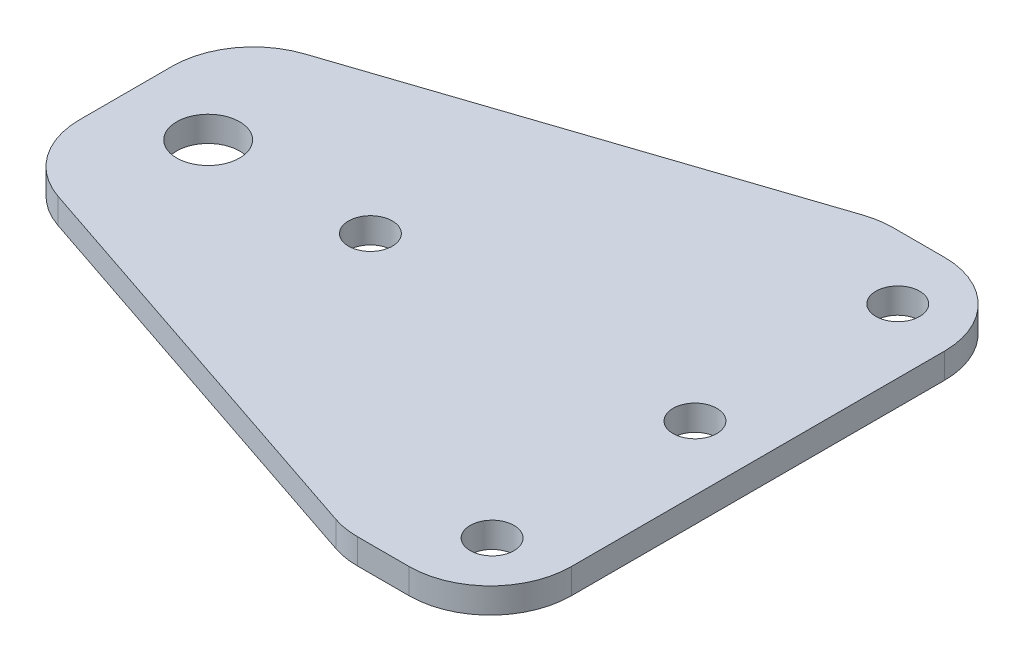
ISO-10303-21;
HEADER;
FILE_DESCRIPTION(('STEP AP214'),'2;1');
FILE_NAME('part.step','',(''),(''),'','','');
FILE_SCHEMA(('AUTOMOTIVE_DESIGN { 1 0 10303 214 1 1 1 1 }'));
ENDSEC;
DATA;
#1=APPLICATION_CONTEXT('core data for automotive mechanical design processes');
#2=APPLICATION_PROTOCOL_DEFINITION('international standard','automotive_design',2000,#1);
#3=PRODUCT_CONTEXT('',#1,'mechanical');
#4=PRODUCT('Part','Part','',(#3));
#5=PRODUCT_RELATED_PRODUCT_CATEGORY('part','',(#4));
#6=PRODUCT_DEFINITION_FORMATION('','',#4);
#7=PRODUCT_DEFINITION_CONTEXT('part definition',#1,'design');
#8=PRODUCT_DEFINITION('design','',#6,#7);
#9=PRODUCT_DEFINITION_SHAPE('','',#8);
#10=(LENGTH_UNIT() NAMED_UNIT(*) SI_UNIT(.MILLI.,.METRE.));
#11=(NAMED_UNIT(*) PLANE_ANGLE_UNIT() SI_UNIT($,.RADIAN.));
#12=(NAMED_UNIT(*) SI_UNIT($,.STERADIAN.) SOLID_ANGLE_UNIT());
#13=UNCERTAINTY_MEASURE_WITH_UNIT(LENGTH_MEASURE(1.E-05),#10,'distance_accuracy_value','');
#14=(GEOMETRIC_REPRESENTATION_CONTEXT(3) GLOBAL_UNCERTAINTY_ASSIGNED_CONTEXT((#13)) GLOBAL_UNIT_ASSIGNED_CONTEXT((#10,
#11,#12)) REPRESENTATION_CONTEXT('',''));
#15=CARTESIAN_POINT('',(0.,0.,0.));
#16=DIRECTION('',(0.,0.,1.));
#17=DIRECTION('',(1.,0.,0.));
#18=AXIS2_PLACEMENT_3D('',#15,#16,#17);
#19=CARTESIAN_POINT('',(0.,3.125,0.));
#20=DIRECTION('',(0.,-1.,0.));
#21=DIRECTION('',(0.,0.,-1.));
#22=AXIS2_PLACEMENT_3D('',#19,#20,#21);
#23=PLANE('',#22);
#24=CARTESIAN_POINT('',(70.0740556078438,3.125,-12.9660845153906));
#25=DIRECTION('',(0.,1.,0.));
#26=DIRECTION('',(0.,0.,1.));
#27=AXIS2_PLACEMENT_3D('',#24,#25,#26);
#28=CIRCLE('',#27,2.7);
#29=CARTESIAN_POINT('',(70.0740556078438,3.125,-10.2660845153906));
#30=VERTEX_POINT('',#29);
#31=EDGE_CURVE('E249',#30,#30,#28,.T.);
#32=ORIENTED_EDGE('',*,*,#31,.F.);
#33=EDGE_LOOP('',(#32));
#34=FACE_BOUND('',#33,.T.);
#35=CARTESIAN_POINT('',(10.0740556078438,3.125,-12.9660845153906));
#36=DIRECTION('',(0.,1.,0.));
#37=DIRECTION('',(0.,0.,1.));
#38=AXIS2_PLACEMENT_3D('',#35,#36,#37);
#39=CIRCLE('',#38,3.87500000000001);
#40=CARTESIAN_POINT('',(10.0740556078438,3.125,-9.09108451539061));
#41=VERTEX_POINT('',#40);
#42=EDGE_CURVE('E237',#41,#41,#39,.T.);
#43=ORIENTED_EDGE('',*,*,#42,.F.);
#44=EDGE_LOOP('',(#43));
#45=FACE_BOUND('',#44,.T.);
#46=DIRECTION('',(0.,0.,-1.));
#47=VECTOR('',#46,1.);
#48=CARTESIAN_POINT('',(77.9999999999998,3.125,-45.8102249731023));
#49=LINE('',#48,#47);
#50=CARTESIAN_POINT('',(77.9999999999998,3.125,10.1897750268977));
#51=VERTEX_POINT('',#50);
#52=CARTESIAN_POINT('',(77.9999999999998,3.125,-35.8102249731023));
#53=VERTEX_POINT('',#52);
#54=EDGE_CURVE('E229',#51,#53,#49,.T.);
#55=ORIENTED_EDGE('',*,*,#54,.T.);
#56=CARTESIAN_POINT('',(67.9999999999998,3.125,-35.8102249731023));
#57=DIRECTION('',(0.,-1.,0.));
#58=DIRECTION('',(0.,0.,-1.));
#59=AXIS2_PLACEMENT_3D('',#56,#57,#58);
#60=CIRCLE('',#59,10.);
#61=CARTESIAN_POINT('',(67.9999999999998,3.125,-45.8102249731023));
#62=VERTEX_POINT('',#61);
#63=EDGE_CURVE('E181',#53,#62,#60,.F.);
#64=ORIENTED_EDGE('',*,*,#63,.T.);
#65=DIRECTION('',(-1.,0.,0.));
#66=VECTOR('',#65,1.);
#67=CARTESIAN_POINT('',(60.,3.125,-45.8102249731023));
#68=LINE('',#67,#66);
#69=CARTESIAN_POINT('',(61.6227766016838,3.125,-45.8102249731023));
#70=VERTEX_POINT('',#69);
#71=EDGE_CURVE('E143',#62,#70,#68,.T.);
#72=ORIENTED_EDGE('',*,*,#71,.T.);
#73=CARTESIAN_POINT('',(61.6227766016838,3.125,-35.8102249731023));
#74=DIRECTION('',(0.,-1.,0.));
#75=DIRECTION('',(0.,0.,-1.));
#76=AXIS2_PLACEMENT_3D('',#73,#74,#75);
#77=CIRCLE('',#76,10.);
#78=CARTESIAN_POINT('',(58.4604989415154,3.125,-45.2970579536074));
#79=VERTEX_POINT('',#78);
#80=EDGE_CURVE('E176',#70,#79,#77,.F.);
#81=ORIENTED_EDGE('',*,*,#80,.T.);
#82=DIRECTION('',(-0.948683298050514,0.,0.316227766016838));
#83=VECTOR('',#82,1.);
#84=CARTESIAN_POINT('',(0.,3.125,-25.8102249731023));
#85=LINE('',#84,#83);
#86=CARTESIAN_POINT('',(6.83772233983162,3.125,-28.0894657530462));
#87=VERTEX_POINT('',#86);
#88=EDGE_CURVE('E151',#79,#87,#85,.T.);
#89=ORIENTED_EDGE('',*,*,#88,.T.);
#90=CARTESIAN_POINT('',(10.,3.125,-18.6026327725411));
#91=DIRECTION('',(0.,-1.,0.));
#92=DIRECTION('',(0.,0.,-1.));
#93=AXIS2_PLACEMENT_3D('',#90,#91,#92);
#94=CIRCLE('',#93,10.);
#95=CARTESIAN_POINT('',(0.,3.125,-18.6026327725411));
#96=VERTEX_POINT('',#95);
#97=EDGE_CURVE('E174',#87,#96,#94,.F.);
#98=ORIENTED_EDGE('',*,*,#97,.T.);
#99=DIRECTION('',(0.,0.,1.));
#100=VECTOR('',#99,1.);
#101=CARTESIAN_POINT('',(0.,3.125,-25.8102249731023));
#102=LINE('',#101,#100);
#103=CARTESIAN_POINT('',(0.,3.125,-7.18600771898826));
#104=VERTEX_POINT('',#103);
#105=EDGE_CURVE('E155',#96,#104,#102,.T.);
#106=ORIENTED_EDGE('',*,*,#105,.T.);
#107=CARTESIAN_POINT('',(10.,3.125,-7.18600771898826));
#108=DIRECTION('',(0.,-1.,0.));
#109=DIRECTION('',(0.,0.,-1.));
#110=AXIS2_PLACEMENT_3D('',#107,#108,#109);
#111=CIRCLE('',#110,10.);
#112=CARTESIAN_POINT('',(6.81075537774013,3.125,2.29179364733012));
#113=VERTEX_POINT('',#112);
#114=EDGE_CURVE('E172',#104,#113,#111,.F.);
#115=ORIENTED_EDGE('',*,*,#114,.T.);
#116=DIRECTION('',(0.947780136631838,0.,0.318924462225987));
#117=VECTOR('',#116,1.);
#118=CARTESIAN_POINT('',(0.,3.125,0.));
#119=LINE('',#118,#117);
#120=CARTESIAN_POINT('',(58.4481294130737,3.125,19.6675763932161));
#121=VERTEX_POINT('',#120);
#122=EDGE_CURVE('E211',#113,#121,#119,.T.);
#123=ORIENTED_EDGE('',*,*,#122,.T.);
#124=CARTESIAN_POINT('',(61.6373740353336,3.125,10.1897750268977));
#125=DIRECTION('',(0.,-1.,0.));
#126=DIRECTION('',(0.,0.,-1.));
#127=AXIS2_PLACEMENT_3D('',#124,#125,#126);
#128=CIRCLE('',#127,10.);
#129=CARTESIAN_POINT('',(61.6373740353336,3.125,20.1897750268977));
#130=VERTEX_POINT('',#129);
#131=EDGE_CURVE('E54',#121,#130,#128,.F.);
#132=ORIENTED_EDGE('',*,*,#131,.T.);
#133=DIRECTION('',(1.,0.,0.));
#134=VECTOR('',#133,1.);
#135=CARTESIAN_POINT('',(77.9999999999998,3.125,20.1897750268977));
#136=LINE('',#135,#134);
#137=CARTESIAN_POINT('',(67.9999999999998,3.125,20.1897750268977));
#138=VERTEX_POINT('',#137);
#139=EDGE_CURVE('E231',#130,#138,#136,.T.);
#140=ORIENTED_EDGE('',*,*,#139,.T.);
#141=CARTESIAN_POINT('',(67.9999999999998,3.125,10.1897750268977));
#142=DIRECTION('',(0.,-1.,0.));
#143=DIRECTION('',(0.,0.,-1.));
#144=AXIS2_PLACEMENT_3D('',#141,#142,#143);
#145=CIRCLE('',#144,10.);
#146=EDGE_CURVE('E179',#138,#51,#145,.F.);
#147=ORIENTED_EDGE('',*,*,#146,.T.);
#148=EDGE_LOOP('',(#55,#64,#72,#81,#89,#98,#106,#115,#123,#132,#140,#147));
#149=FACE_BOUND('',#148,.T.);
#150=CARTESIAN_POINT('',(70.0740556078438,3.125,12.0339154846094));
#151=DIRECTION('',(0.,1.,0.));
#152=DIRECTION('',(0.,0.,1.));
#153=AXIS2_PLACEMENT_3D('',#150,#151,#152);
#154=CIRCLE('',#153,2.7);
#155=CARTESIAN_POINT('',(70.0740556078438,3.125,14.7339154846094));
#156=VERTEX_POINT('',#155);
#157=EDGE_CURVE('E227',#156,#156,#154,.T.);
#158=ORIENTED_EDGE('',*,*,#157,.F.);
#159=EDGE_LOOP('',(#158));
#160=FACE_BOUND('',#159,.T.);
#161=CARTESIAN_POINT('',(70.0740556078438,3.125,-37.9660845153906));
#162=DIRECTION('',(0.,1.,0.));
#163=DIRECTION('',(0.,0.,1.));
#164=AXIS2_PLACEMENT_3D('',#161,#162,#163);
#165=CIRCLE('',#164,2.7);
#166=CARTESIAN_POINT('',(70.0740556078438,3.125,-35.2660845153906));
#167=VERTEX_POINT('',#166);
#168=EDGE_CURVE('E243',#167,#167,#165,.T.);
#169=ORIENTED_EDGE('',*,*,#168,.F.);
#170=EDGE_LOOP('',(#169));
#171=FACE_BOUND('',#170,.T.);
#172=CARTESIAN_POINT('',(30.0740556078438,3.125,-12.9660845153907));
#173=DIRECTION('',(0.,1.,0.));
#174=DIRECTION('',(0.,0.,1.));
#175=AXIS2_PLACEMENT_3D('',#172,#173,#174);
#176=CIRCLE('',#175,2.7);
#177=CARTESIAN_POINT('',(30.0740556078438,3.125,-10.2660845153907));
#178=VERTEX_POINT('',#177);
#179=EDGE_CURVE('E255',#178,#178,#176,.T.);
#180=ORIENTED_EDGE('',*,*,#179,.F.);
#181=EDGE_LOOP('',(#180));
#182=FACE_BOUND('',#181,.T.);
#183=ADVANCED_FACE('F32',(#34,#45,#149,#160,#171,#182),#23,.F.);
#184=CARTESIAN_POINT('',(0.,0.,0.));
#185=DIRECTION('',(0.,-1.,0.));
#186=DIRECTION('',(0.,0.,-1.));
#187=AXIS2_PLACEMENT_3D('',#184,#185,#186);
#188=PLANE('',#187);
#189=CARTESIAN_POINT('',(70.0740556078438,0.,-12.9660845153906));
#190=DIRECTION('',(0.,1.,0.));
#191=DIRECTION('',(0.,0.,1.));
#192=AXIS2_PLACEMENT_3D('',#189,#190,#191);
#193=CIRCLE('',#192,2.7);
#194=CARTESIAN_POINT('',(70.0740556078438,0.,-10.2660845153906));
#195=VERTEX_POINT('',#194);
#196=EDGE_CURVE('E252',#195,#195,#193,.T.);
#197=ORIENTED_EDGE('',*,*,#196,.T.);
#198=EDGE_LOOP('',(#197));
#199=FACE_BOUND('',#198,.T.);
#200=CARTESIAN_POINT('',(10.0740556078438,0.,-12.9660845153906));
#201=DIRECTION('',(0.,1.,0.));
#202=DIRECTION('',(0.,0.,1.));
#203=AXIS2_PLACEMENT_3D('',#200,#201,#202);
#204=CIRCLE('',#203,3.87500000000001);
#205=CARTESIAN_POINT('',(10.0740556078438,0.,-9.09108451539061));
#206=VERTEX_POINT('',#205);
#207=EDGE_CURVE('E240',#206,#206,#204,.T.);
#208=ORIENTED_EDGE('',*,*,#207,.T.);
#209=EDGE_LOOP('',(#208));
#210=FACE_BOUND('',#209,.T.);
#211=DIRECTION('',(-1.,0.,0.));
#212=VECTOR('',#211,1.);
#213=CARTESIAN_POINT('',(60.,0.,-45.8102249731023));
#214=LINE('',#213,#212);
#215=CARTESIAN_POINT('',(67.9999999999998,0.,-45.8102249731023));
#216=VERTEX_POINT('',#215);
#217=CARTESIAN_POINT('',(61.6227766016838,0.,-45.8102249731023));
#218=VERTEX_POINT('',#217);
#219=EDGE_CURVE('E140',#216,#218,#214,.T.);
#220=ORIENTED_EDGE('',*,*,#219,.F.);
#221=CARTESIAN_POINT('',(67.9999999999998,0.,-35.8102249731023));
#222=DIRECTION('',(0.,-1.,0.));
#223=DIRECTION('',(0.,0.,-1.));
#224=AXIS2_PLACEMENT_3D('',#221,#222,#223);
#225=CIRCLE('',#224,10.);
#226=CARTESIAN_POINT('',(77.9999999999998,0.,-35.8102249731023));
#227=VERTEX_POINT('',#226);
#228=EDGE_CURVE('E123',#216,#227,#225,.T.);
#229=ORIENTED_EDGE('',*,*,#228,.T.);
#230=DIRECTION('',(0.,0.,-1.));
#231=VECTOR('',#230,1.);
#232=CARTESIAN_POINT('',(77.9999999999998,0.,-45.8102249731023));
#233=LINE('',#232,#231);
#234=CARTESIAN_POINT('',(77.9999999999998,0.,10.1897750268977));
#235=VERTEX_POINT('',#234);
#236=EDGE_CURVE('E152',#235,#227,#233,.T.);
#237=ORIENTED_EDGE('',*,*,#236,.F.);
#238=CARTESIAN_POINT('',(67.9999999999998,0.,10.1897750268977));
#239=DIRECTION('',(0.,-1.,0.));
#240=DIRECTION('',(0.,0.,-1.));
#241=AXIS2_PLACEMENT_3D('',#238,#239,#240);
#242=CIRCLE('',#241,10.);
#243=CARTESIAN_POINT('',(67.9999999999998,0.,20.1897750268977));
#244=VERTEX_POINT('',#243);
#245=EDGE_CURVE('E134',#235,#244,#242,.T.);
#246=ORIENTED_EDGE('',*,*,#245,.T.);
#247=DIRECTION('',(1.,0.,0.));
#248=VECTOR('',#247,1.);
#249=CARTESIAN_POINT('',(77.9999999999998,0.,20.1897750268977));
#250=LINE('',#249,#248);
#251=CARTESIAN_POINT('',(61.6373740353336,0.,20.1897750268977));
#252=VERTEX_POINT('',#251);
#253=EDGE_CURVE('E157',#252,#244,#250,.T.);
#254=ORIENTED_EDGE('',*,*,#253,.F.);
#255=CARTESIAN_POINT('',(61.6373740353336,0.,10.1897750268977));
#256=DIRECTION('',(0.,-1.,0.));
#257=DIRECTION('',(0.,0.,-1.));
#258=AXIS2_PLACEMENT_3D('',#255,#256,#257);
#259=CIRCLE('',#258,10.);
#260=CARTESIAN_POINT('',(58.4481294130737,0.,19.6675763932161));
#261=VERTEX_POINT('',#260);
#262=EDGE_CURVE('E166',#252,#261,#259,.T.);
#263=ORIENTED_EDGE('',*,*,#262,.T.);
#264=DIRECTION('',(0.947780136631838,0.,0.318924462225987));
#265=VECTOR('',#264,1.);
#266=CARTESIAN_POINT('',(0.,0.,0.));
#267=LINE('',#266,#265);
#268=CARTESIAN_POINT('',(6.81075537774013,0.,2.29179364733012));
#269=VERTEX_POINT('',#268);
#270=EDGE_CURVE('E218',#269,#261,#267,.T.);
#271=ORIENTED_EDGE('',*,*,#270,.F.);
#272=CARTESIAN_POINT('',(10.,0.,-7.18600771898826));
#273=DIRECTION('',(0.,-1.,0.));
#274=DIRECTION('',(0.,0.,-1.));
#275=AXIS2_PLACEMENT_3D('',#272,#273,#274);
#276=CIRCLE('',#275,10.);
#277=CARTESIAN_POINT('',(0.,0.,-7.18600771898826));
#278=VERTEX_POINT('',#277);
#279=EDGE_CURVE('E144',#269,#278,#276,.T.);
#280=ORIENTED_EDGE('',*,*,#279,.T.);
#281=DIRECTION('',(0.,0.,1.));
#282=VECTOR('',#281,1.);
#283=CARTESIAN_POINT('',(0.,0.,-25.8102249731023));
#284=LINE('',#283,#282);
#285=CARTESIAN_POINT('',(0.,0.,-18.6026327725411));
#286=VERTEX_POINT('',#285);
#287=EDGE_CURVE('E204',#286,#278,#284,.T.);
#288=ORIENTED_EDGE('',*,*,#287,.F.);
#289=CARTESIAN_POINT('',(10.,0.,-18.6026327725411));
#290=DIRECTION('',(0.,-1.,0.));
#291=DIRECTION('',(0.,0.,-1.));
#292=AXIS2_PLACEMENT_3D('',#289,#290,#291);
#293=CIRCLE('',#292,10.);
#294=CARTESIAN_POINT('',(6.83772233983162,0.,-28.0894657530462));
#295=VERTEX_POINT('',#294);
#296=EDGE_CURVE('E163',#286,#295,#293,.T.);
#297=ORIENTED_EDGE('',*,*,#296,.T.);
#298=DIRECTION('',(-0.948683298050514,0.,0.316227766016838));
#299=VECTOR('',#298,1.);
#300=CARTESIAN_POINT('',(0.,0.,-25.8102249731023));
#301=LINE('',#300,#299);
#302=CARTESIAN_POINT('',(58.4604989415154,0.,-45.2970579536074));
#303=VERTEX_POINT('',#302);
#304=EDGE_CURVE('E222',#303,#295,#301,.T.);
#305=ORIENTED_EDGE('',*,*,#304,.F.);
#306=CARTESIAN_POINT('',(61.6227766016838,0.,-35.8102249731023));
#307=DIRECTION('',(0.,-1.,0.));
#308=DIRECTION('',(0.,0.,-1.));
#309=AXIS2_PLACEMENT_3D('',#306,#307,#308);
#310=CIRCLE('',#309,10.);
#311=EDGE_CURVE('E150',#303,#218,#310,.T.);
#312=ORIENTED_EDGE('',*,*,#311,.T.);
#313=EDGE_LOOP('',(#220,#229,#237,#246,#254,#263,#271,#280,#288,#297,#305,#312));
#314=FACE_BOUND('',#313,.T.);
#315=CARTESIAN_POINT('',(70.0740556078438,0.,12.0339154846094));
#316=DIRECTION('',(0.,1.,0.));
#317=DIRECTION('',(0.,0.,1.));
#318=AXIS2_PLACEMENT_3D('',#315,#316,#317);
#319=CIRCLE('',#318,2.7);
#320=CARTESIAN_POINT('',(70.0740556078438,0.,14.7339154846094));
#321=VERTEX_POINT('',#320);
#322=EDGE_CURVE('E234',#321,#321,#319,.T.);
#323=ORIENTED_EDGE('',*,*,#322,.T.);
#324=EDGE_LOOP('',(#323));
#325=FACE_BOUND('',#324,.T.);
#326=CARTESIAN_POINT('',(70.0740556078438,0.,-37.9660845153906));
#327=DIRECTION('',(0.,1.,0.));
#328=DIRECTION('',(0.,0.,1.));
#329=AXIS2_PLACEMENT_3D('',#326,#327,#328);
#330=CIRCLE('',#329,2.7);
#331=CARTESIAN_POINT('',(70.0740556078438,0.,-35.2660845153906));
#332=VERTEX_POINT('',#331);
#333=EDGE_CURVE('E246',#332,#332,#330,.T.);
#334=ORIENTED_EDGE('',*,*,#333,.T.);
#335=EDGE_LOOP('',(#334));
#336=FACE_BOUND('',#335,.T.);
#337=CARTESIAN_POINT('',(30.0740556078438,0.,-12.9660845153907));
#338=DIRECTION('',(0.,1.,0.));
#339=DIRECTION('',(0.,0.,1.));
#340=AXIS2_PLACEMENT_3D('',#337,#338,#339);
#341=CIRCLE('',#340,2.7);
#342=CARTESIAN_POINT('',(30.0740556078438,0.,-10.2660845153907));
#343=VERTEX_POINT('',#342);
#344=EDGE_CURVE('E258',#343,#343,#341,.T.);
#345=ORIENTED_EDGE('',*,*,#344,.T.);
#346=EDGE_LOOP('',(#345));
#347=FACE_BOUND('',#346,.T.);
#348=ADVANCED_FACE('F147',(#199,#210,#314,#325,#336,#347),#188,.T.);
#349=CARTESIAN_POINT('',(0.,3.125,-25.8102249731023));
#350=DIRECTION('',(0.316227766016838,0.,0.948683298050514));
#351=DIRECTION('',(0.948683298050514,0.,-0.316227766016838));
#352=AXIS2_PLACEMENT_3D('',#349,#350,#351);
#353=PLANE('',#352);
#354=ORIENTED_EDGE('',*,*,#88,.F.);
#355=DIRECTION('',(0.,-1.,0.));
#356=VECTOR('',#355,1.);
#357=CARTESIAN_POINT('',(58.4604989415154,3.125,-45.2970579536074));
#358=LINE('',#357,#356);
#359=EDGE_CURVE('E194',#79,#303,#358,.T.);
#360=ORIENTED_EDGE('',*,*,#359,.T.);
#361=ORIENTED_EDGE('',*,*,#304,.T.);
#362=DIRECTION('',(0.,-1.,0.));
#363=VECTOR('',#362,1.);
#364=CARTESIAN_POINT('',(6.83772233983162,3.125,-28.0894657530462));
#365=LINE('',#364,#363);
#366=EDGE_CURVE('E192',#295,#87,#365,.F.);
#367=ORIENTED_EDGE('',*,*,#366,.T.);
#368=EDGE_LOOP('',(#354,#360,#361,#367));
#369=FACE_BOUND('',#368,.T.);
#370=ADVANCED_FACE('F273',(#369),#353,.F.);
#371=CARTESIAN_POINT('',(0.,3.125,-25.8102249731023));
#372=DIRECTION('',(1.,0.,0.));
#373=DIRECTION('',(0.,0.,-1.));
#374=AXIS2_PLACEMENT_3D('',#371,#372,#373);
#375=PLANE('',#374);
#376=ORIENTED_EDGE('',*,*,#105,.F.);
#377=DIRECTION('',(0.,-1.,0.));
#378=VECTOR('',#377,1.);
#379=CARTESIAN_POINT('',(0.,3.125,-18.6026327725411));
#380=LINE('',#379,#378);
#381=EDGE_CURVE('E11',#96,#286,#380,.T.);
#382=ORIENTED_EDGE('',*,*,#381,.T.);
#383=ORIENTED_EDGE('',*,*,#287,.T.);
#384=DIRECTION('',(0.,-1.,0.));
#385=VECTOR('',#384,1.);
#386=CARTESIAN_POINT('',(0.,3.125,-7.18600771898826));
#387=LINE('',#386,#385);
#388=EDGE_CURVE('E40',#278,#104,#387,.F.);
#389=ORIENTED_EDGE('',*,*,#388,.T.);
#390=EDGE_LOOP('',(#376,#382,#383,#389));
#391=FACE_BOUND('',#390,.T.);
#392=ADVANCED_FACE('F201',(#391),#375,.F.);
#393=CARTESIAN_POINT('',(0.,3.125,0.));
#394=DIRECTION('',(0.318924462225987,0.,-0.947780136631838));
#395=DIRECTION('',(-0.947780136631838,0.,-0.318924462225987));
#396=AXIS2_PLACEMENT_3D('',#393,#394,#395);
#397=PLANE('',#396);
#398=ORIENTED_EDGE('',*,*,#270,.T.);
#399=DIRECTION('',(0.,-1.,0.));
#400=VECTOR('',#399,1.);
#401=CARTESIAN_POINT('',(58.4481294130737,3.125,19.6675763932161));
#402=LINE('',#401,#400);
#403=EDGE_CURVE('E190',#261,#121,#402,.F.);
#404=ORIENTED_EDGE('',*,*,#403,.T.);
#405=ORIENTED_EDGE('',*,*,#122,.F.);
#406=DIRECTION('',(0.,-1.,0.));
#407=VECTOR('',#406,1.);
#408=CARTESIAN_POINT('',(6.81075537774013,3.125,2.29179364733012));
#409=LINE('',#408,#407);
#410=EDGE_CURVE('E187',#113,#269,#409,.T.);
#411=ORIENTED_EDGE('',*,*,#410,.T.);
#412=EDGE_LOOP('',(#398,#404,#405,#411));
#413=FACE_BOUND('',#412,.T.);
#414=ADVANCED_FACE('F217',(#413),#397,.F.);
#415=CARTESIAN_POINT('',(77.9999999999998,3.125,20.1897750268977));
#416=DIRECTION('',(0.,0.,-1.));
#417=DIRECTION('',(-1.,0.,0.));
#418=AXIS2_PLACEMENT_3D('',#415,#416,#417);
#419=PLANE('',#418);
#420=ORIENTED_EDGE('',*,*,#253,.T.);
#421=DIRECTION('',(0.,-1.,0.));
#422=VECTOR('',#421,1.);
#423=CARTESIAN_POINT('',(67.9999999999998,3.125,20.1897750268977));
#424=LINE('',#423,#422);
#425=EDGE_CURVE('E47',#244,#138,#424,.F.);
#426=ORIENTED_EDGE('',*,*,#425,.T.);
#427=ORIENTED_EDGE('',*,*,#139,.F.);
#428=DIRECTION('',(0.,-1.,0.));
#429=VECTOR('',#428,1.);
#430=CARTESIAN_POINT('',(61.6373740353336,3.125,20.1897750268977));
#431=LINE('',#430,#429);
#432=EDGE_CURVE('E183',#130,#252,#431,.T.);
#433=ORIENTED_EDGE('',*,*,#432,.T.);
#434=EDGE_LOOP('',(#420,#426,#427,#433));
#435=FACE_BOUND('',#434,.T.);
#436=ADVANCED_FACE('F287',(#435),#419,.F.);
#437=CARTESIAN_POINT('',(77.9999999999998,3.125,-45.8102249731023));
#438=DIRECTION('',(-1.,0.,0.));
#439=DIRECTION('',(0.,0.,1.));
#440=AXIS2_PLACEMENT_3D('',#437,#438,#439);
#441=PLANE('',#440);
#442=ORIENTED_EDGE('',*,*,#236,.T.);
#443=DIRECTION('',(0.,-1.,0.));
#444=VECTOR('',#443,1.);
#445=CARTESIAN_POINT('',(77.9999999999998,3.125,-35.8102249731023));
#446=LINE('',#445,#444);
#447=EDGE_CURVE('E128',#227,#53,#446,.F.);
#448=ORIENTED_EDGE('',*,*,#447,.T.);
#449=ORIENTED_EDGE('',*,*,#54,.F.);
#450=DIRECTION('',(0.,-1.,0.));
#451=VECTOR('',#450,1.);
#452=CARTESIAN_POINT('',(77.9999999999998,3.125,10.1897750268977));
#453=LINE('',#452,#451);
#454=EDGE_CURVE('E133',#51,#235,#453,.T.);
#455=ORIENTED_EDGE('',*,*,#454,.T.);
#456=EDGE_LOOP('',(#442,#448,#449,#455));
#457=FACE_BOUND('',#456,.T.);
#458=ADVANCED_FACE('F284',(#457),#441,.F.);
#459=CARTESIAN_POINT('',(60.,3.125,-45.8102249731023));
#460=DIRECTION('',(0.,0.,1.));
#461=DIRECTION('',(1.,0.,0.));
#462=AXIS2_PLACEMENT_3D('',#459,#460,#461);
#463=PLANE('',#462);
#464=ORIENTED_EDGE('',*,*,#71,.F.);
#465=DIRECTION('',(0.,-1.,0.));
#466=VECTOR('',#465,1.);
#467=CARTESIAN_POINT('',(67.9999999999998,3.125,-45.8102249731023));
#468=LINE('',#467,#466);
#469=EDGE_CURVE('E127',#62,#216,#468,.T.);
#470=ORIENTED_EDGE('',*,*,#469,.T.);
#471=ORIENTED_EDGE('',*,*,#219,.T.);
#472=DIRECTION('',(0.,-1.,0.));
#473=VECTOR('',#472,1.);
#474=CARTESIAN_POINT('',(61.6227766016838,3.125,-45.8102249731023));
#475=LINE('',#474,#473);
#476=EDGE_CURVE('E145',#218,#70,#475,.F.);
#477=ORIENTED_EDGE('',*,*,#476,.T.);
#478=EDGE_LOOP('',(#464,#470,#471,#477));
#479=FACE_BOUND('',#478,.T.);
#480=ADVANCED_FACE('F139',(#479),#463,.F.);
#481=CARTESIAN_POINT('',(70.0740556078438,3.125,12.0339154846094));
#482=DIRECTION('',(0.,-1.,0.));
#483=DIRECTION('',(0.,0.,-1.));
#484=AXIS2_PLACEMENT_3D('',#481,#482,#483);
#485=CYLINDRICAL_SURFACE('',#484,2.7);
#486=ORIENTED_EDGE('',*,*,#157,.T.);
#487=EDGE_LOOP('',(#486));
#488=FACE_BOUND('',#487,.T.);
#489=ORIENTED_EDGE('',*,*,#322,.F.);
#490=EDGE_LOOP('',(#489));
#491=FACE_BOUND('',#490,.T.);
#492=ADVANCED_FACE('F279',(#488,#491),#485,.F.);
#493=CARTESIAN_POINT('',(10.0740556078438,3.125,-12.9660845153906));
#494=DIRECTION('',(0.,-1.,0.));
#495=DIRECTION('',(0.,0.,-1.));
#496=AXIS2_PLACEMENT_3D('',#493,#494,#495);
#497=CYLINDRICAL_SURFACE('',#496,3.87500000000001);
#498=ORIENTED_EDGE('',*,*,#42,.T.);
#499=EDGE_LOOP('',(#498));
#500=FACE_BOUND('',#499,.T.);
#501=ORIENTED_EDGE('',*,*,#207,.F.);
#502=EDGE_LOOP('',(#501));
#503=FACE_BOUND('',#502,.T.);
#504=ADVANCED_FACE('F431',(#500,#503),#497,.F.);
#505=CARTESIAN_POINT('',(70.0740556078438,3.125,-37.9660845153906));
#506=DIRECTION('',(0.,-1.,0.));
#507=DIRECTION('',(0.,0.,-1.));
#508=AXIS2_PLACEMENT_3D('',#505,#506,#507);
#509=CYLINDRICAL_SURFACE('',#508,2.7);
#510=ORIENTED_EDGE('',*,*,#168,.T.);
#511=EDGE_LOOP('',(#510));
#512=FACE_BOUND('',#511,.T.);
#513=ORIENTED_EDGE('',*,*,#333,.F.);
#514=EDGE_LOOP('',(#513));
#515=FACE_BOUND('',#514,.T.);
#516=ADVANCED_FACE('F421',(#512,#515),#509,.F.);
#517=CARTESIAN_POINT('',(70.0740556078438,3.125,-12.9660845153906));
#518=DIRECTION('',(0.,-1.,0.));
#519=DIRECTION('',(0.,0.,-1.));
#520=AXIS2_PLACEMENT_3D('',#517,#518,#519);
#521=CYLINDRICAL_SURFACE('',#520,2.7);
#522=ORIENTED_EDGE('',*,*,#31,.T.);
#523=EDGE_LOOP('',(#522));
#524=FACE_BOUND('',#523,.T.);
#525=ORIENTED_EDGE('',*,*,#196,.F.);
#526=EDGE_LOOP('',(#525));
#527=FACE_BOUND('',#526,.T.);
#528=ADVANCED_FACE('F412',(#524,#527),#521,.F.);
#529=CARTESIAN_POINT('',(30.0740556078438,3.125,-12.9660845153907));
#530=DIRECTION('',(0.,-1.,0.));
#531=DIRECTION('',(0.,0.,-1.));
#532=AXIS2_PLACEMENT_3D('',#529,#530,#531);
#533=CYLINDRICAL_SURFACE('',#532,2.7);
#534=ORIENTED_EDGE('',*,*,#179,.T.);
#535=EDGE_LOOP('',(#534));
#536=FACE_BOUND('',#535,.T.);
#537=ORIENTED_EDGE('',*,*,#344,.F.);
#538=EDGE_LOOP('',(#537));
#539=FACE_BOUND('',#538,.T.);
#540=ADVANCED_FACE('F264',(#536,#539),#533,.F.);
#541=CARTESIAN_POINT('',(67.9999999999998,3.125,-35.8102249731023));
#542=DIRECTION('',(0.,-1.,0.));
#543=DIRECTION('',(0.,0.,-1.));
#544=AXIS2_PLACEMENT_3D('',#541,#542,#543);
#545=CYLINDRICAL_SURFACE('',#544,10.);
#546=ORIENTED_EDGE('',*,*,#63,.F.);
#547=ORIENTED_EDGE('',*,*,#447,.F.);
#548=ORIENTED_EDGE('',*,*,#228,.F.);
#549=ORIENTED_EDGE('',*,*,#469,.F.);
#550=EDGE_LOOP('',(#546,#547,#548,#549));
#551=FACE_BOUND('',#550,.T.);
#552=ADVANCED_FACE('F126',(#551),#545,.T.);
#553=CARTESIAN_POINT('',(67.9999999999998,3.125,10.1897750268977));
#554=DIRECTION('',(0.,-1.,0.));
#555=DIRECTION('',(0.,0.,-1.));
#556=AXIS2_PLACEMENT_3D('',#553,#554,#555);
#557=CYLINDRICAL_SURFACE('',#556,10.);
#558=ORIENTED_EDGE('',*,*,#146,.F.);
#559=ORIENTED_EDGE('',*,*,#425,.F.);
#560=ORIENTED_EDGE('',*,*,#245,.F.);
#561=ORIENTED_EDGE('',*,*,#454,.F.);
#562=EDGE_LOOP('',(#558,#559,#560,#561));
#563=FACE_BOUND('',#562,.T.);
#564=ADVANCED_FACE('F300',(#563),#557,.T.);
#565=CARTESIAN_POINT('',(61.6373740353336,3.125,10.1897750268977));
#566=DIRECTION('',(0.,-1.,0.));
#567=DIRECTION('',(0.,0.,-1.));
#568=AXIS2_PLACEMENT_3D('',#565,#566,#567);
#569=CYLINDRICAL_SURFACE('',#568,10.);
#570=ORIENTED_EDGE('',*,*,#131,.F.);
#571=ORIENTED_EDGE('',*,*,#403,.F.);
#572=ORIENTED_EDGE('',*,*,#262,.F.);
#573=ORIENTED_EDGE('',*,*,#432,.F.);
#574=EDGE_LOOP('',(#570,#571,#572,#573));
#575=FACE_BOUND('',#574,.T.);
#576=ADVANCED_FACE('F303',(#575),#569,.T.);
#577=CARTESIAN_POINT('',(61.6227766016838,3.125,-35.8102249731023));
#578=DIRECTION('',(0.,-1.,0.));
#579=DIRECTION('',(0.,0.,-1.));
#580=AXIS2_PLACEMENT_3D('',#577,#578,#579);
#581=CYLINDRICAL_SURFACE('',#580,10.);
#582=ORIENTED_EDGE('',*,*,#80,.F.);
#583=ORIENTED_EDGE('',*,*,#476,.F.);
#584=ORIENTED_EDGE('',*,*,#311,.F.);
#585=ORIENTED_EDGE('',*,*,#359,.F.);
#586=EDGE_LOOP('',(#582,#583,#584,#585));
#587=FACE_BOUND('',#586,.T.);
#588=ADVANCED_FACE('F307',(#587),#581,.T.);
#589=CARTESIAN_POINT('',(10.,3.125,-18.6026327725411));
#590=DIRECTION('',(0.,-1.,0.));
#591=DIRECTION('',(0.,0.,-1.));
#592=AXIS2_PLACEMENT_3D('',#589,#590,#591);
#593=CYLINDRICAL_SURFACE('',#592,10.);
#594=ORIENTED_EDGE('',*,*,#97,.F.);
#595=ORIENTED_EDGE('',*,*,#366,.F.);
#596=ORIENTED_EDGE('',*,*,#296,.F.);
#597=ORIENTED_EDGE('',*,*,#381,.F.);
#598=EDGE_LOOP('',(#594,#595,#596,#597));
#599=FACE_BOUND('',#598,.T.);
#600=ADVANCED_FACE('F310',(#599),#593,.T.);
#601=CARTESIAN_POINT('',(10.,3.125,-7.18600771898826));
#602=DIRECTION('',(0.,-1.,0.));
#603=DIRECTION('',(0.,0.,-1.));
#604=AXIS2_PLACEMENT_3D('',#601,#602,#603);
#605=CYLINDRICAL_SURFACE('',#604,10.);
#606=ORIENTED_EDGE('',*,*,#114,.F.);
#607=ORIENTED_EDGE('',*,*,#388,.F.);
#608=ORIENTED_EDGE('',*,*,#279,.F.);
#609=ORIENTED_EDGE('',*,*,#410,.F.);
#610=EDGE_LOOP('',(#606,#607,#608,#609));
#611=FACE_BOUND('',#610,.T.);
#612=ADVANCED_FACE('F34',(#611),#605,.T.);
#613=CLOSED_SHELL('',(#183,#348,#370,#392,#414,#436,#458,#480,#492,#504,#516,#528,#540,#552,
#564,#576,#588,#600,#612));
#614=MANIFOLD_SOLID_BREP('B2',#613);
#615=ADVANCED_BREP_SHAPE_REPRESENTATION('',(#18,#614),#14);
#616=SHAPE_DEFINITION_REPRESENTATION(#9,#615);
ENDSEC;
END-ISO-10303-21;
